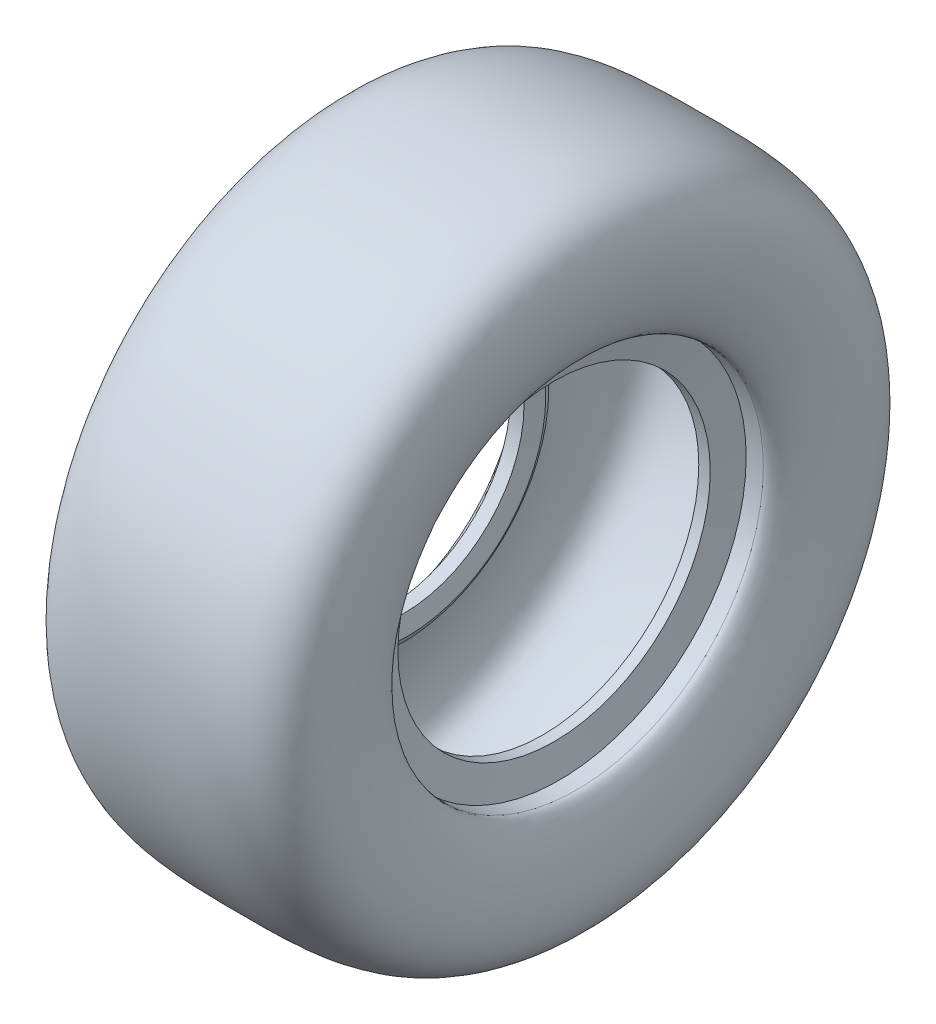
ISO-10303-21;
HEADER;
FILE_DESCRIPTION(('STEP AP214'),'2;1');
FILE_NAME('part.step','',(''),(''),'','','');
FILE_SCHEMA(('AUTOMOTIVE_DESIGN { 1 0 10303 214 1 1 1 1 }'));
ENDSEC;
DATA;
#1=APPLICATION_CONTEXT('core data for automotive mechanical design processes');
#2=APPLICATION_PROTOCOL_DEFINITION('international standard','automotive_design',2000,#1);
#3=PRODUCT_CONTEXT('',#1,'mechanical');
#4=PRODUCT('Part','Part','',(#3));
#5=PRODUCT_RELATED_PRODUCT_CATEGORY('part','',(#4));
#6=PRODUCT_DEFINITION_FORMATION('','',#4);
#7=PRODUCT_DEFINITION_CONTEXT('part definition',#1,'design');
#8=PRODUCT_DEFINITION('design','',#6,#7);
#9=PRODUCT_DEFINITION_SHAPE('','',#8);
#10=(LENGTH_UNIT() NAMED_UNIT(*) SI_UNIT(.MILLI.,.METRE.));
#11=(NAMED_UNIT(*) PLANE_ANGLE_UNIT() SI_UNIT($,.RADIAN.));
#12=(NAMED_UNIT(*) SI_UNIT($,.STERADIAN.) SOLID_ANGLE_UNIT());
#13=UNCERTAINTY_MEASURE_WITH_UNIT(LENGTH_MEASURE(1.E-05),#10,'distance_accuracy_value','');
#14=(GEOMETRIC_REPRESENTATION_CONTEXT(3) GLOBAL_UNCERTAINTY_ASSIGNED_CONTEXT((#13)) GLOBAL_UNIT_ASSIGNED_CONTEXT((#10,
#11,#12)) REPRESENTATION_CONTEXT('',''));
#15=CARTESIAN_POINT('',(0.,0.,0.));
#16=DIRECTION('',(0.,0.,1.));
#17=DIRECTION('',(1.,0.,0.));
#18=AXIS2_PLACEMENT_3D('',#15,#16,#17);
#19=CARTESIAN_POINT('',(3.47266272488094,0.,0.));
#20=DIRECTION('',(-1.,0.,0.));
#21=DIRECTION('',(0.,0.,-1.));
#22=AXIS2_PLACEMENT_3D('',#19,#20,#21);
#23=CONICAL_SURFACE('',#22,17.2497028424639,0.404120577249094);
#24=CARTESIAN_POINT('',(0.594925280990503,0.,0.));
#25=DIRECTION('',(1.,0.,0.));
#26=DIRECTION('',(0.,0.,-1.));
#27=AXIS2_PLACEMENT_3D('',#24,#25,#26);
#28=CIRCLE('',#27,18.4803927868311);
#29=CARTESIAN_POINT('',(0.594925280990503,0.,-18.4803927868311));
#30=VERTEX_POINT('',#29);
#31=EDGE_CURVE('E10',#30,#30,#28,.T.);
#32=ORIENTED_EDGE('',*,*,#31,.T.);
#33=EDGE_LOOP('',(#32));
#34=FACE_BOUND('',#33,.T.);
#35=CARTESIAN_POINT('',(3.47266272488094,0.,0.));
#36=DIRECTION('',(1.,0.,0.));
#37=DIRECTION('',(0.,0.,-1.));
#38=AXIS2_PLACEMENT_3D('',#35,#36,#37);
#39=CIRCLE('',#38,17.2497028424639);
#40=CARTESIAN_POINT('',(3.47266272488094,0.,-17.2497028424639));
#41=VERTEX_POINT('',#40);
#42=EDGE_CURVE('E79',#41,#41,#39,.T.);
#43=ORIENTED_EDGE('',*,*,#42,.F.);
#44=EDGE_LOOP('',(#43));
#45=FACE_BOUND('',#44,.T.);
#46=ADVANCED_FACE('F33',(#34,#45),#23,.T.);
#47=CARTESIAN_POINT('',(0.594925280990491,18.4803927868311,0.));
#48=CARTESIAN_POINT('',(0.569372414542747,18.5081393680591,0.));
#49=CARTESIAN_POINT('',(0.525924239900733,18.5581848339355,0.));
#50=CARTESIAN_POINT('',(0.397789803641084,18.7197551683618,0.));
#51=CARTESIAN_POINT('',(0.20974377840643,18.9880501712404,0.));
#52=CARTESIAN_POINT('',(-0.0508523057953109,19.4100666384776,0.));
#53=CARTESIAN_POINT('',(-0.425084340900271,20.0840697441278,0.));
#54=CARTESIAN_POINT('',(-0.92303713033543,21.1101980177015,0.));
#55=CARTESIAN_POINT('',(-1.51660991726433,22.5639882404766,0.));
#56=CARTESIAN_POINT('',(-2.06345695898781,24.1779072461253,0.));
#57=CARTESIAN_POINT('',(-2.67668909722757,26.461967083874,0.));
#58=CARTESIAN_POINT('',(-3.13114524078678,29.4130902317947,0.));
#59=CARTESIAN_POINT('',(-2.90103725802214,32.5972257606739,0.));
#60=CARTESIAN_POINT('',(-1.98627137097752,34.5018215049126,0.));
#61=CARTESIAN_POINT('',(-0.815019700796387,35.5539158900898,0.));
#62=CARTESIAN_POINT('',(0.896449389503229,36.3885152191131,0.));
#63=CARTESIAN_POINT('',(4.17109004104652,36.9928783683698,0.));
#64=CARTESIAN_POINT('',(8.25481268728258,37.0872177282114,0.));
#65=CARTESIAN_POINT('',(11.7033864270957,37.062973692024,0.));
#66=CARTESIAN_POINT('',(15.1448426824585,37.0523134228786,0.));
#67=CARTESIAN_POINT('',(19.1330908105304,36.9300623418286,0.));
#68=CARTESIAN_POINT('',(22.2430027655649,36.2366041693048,0.));
#69=CARTESIAN_POINT('',(23.9001679162623,35.2636784086857,0.));
#70=CARTESIAN_POINT('',(24.7640377243279,34.3287891412374,0.));
#71=CARTESIAN_POINT('',(25.3525611301634,33.0512886276891,0.));
#72=CARTESIAN_POINT('',(25.6033579101598,31.0992616310925,0.));
#73=CARTESIAN_POINT('',(25.4706804883609,28.7019552678981,0.));
#74=CARTESIAN_POINT('',(25.1062391025157,26.7098719335728,0.));
#75=CARTESIAN_POINT('',(24.7182864232961,25.2972064642427,0.));
#76=CARTESIAN_POINT('',(24.3959823073389,24.3772942437871,0.));
#77=CARTESIAN_POINT('',(24.126684853968,23.7803682980975,0.));
#78=CARTESIAN_POINT('',(23.9235543703579,23.4257016547187,0.));
#79=CARTESIAN_POINT('',(23.8552897921762,23.3247909705258,0.));
#80=CARTESIAN_POINT('',(23.8123289766661,23.268126497952,0.));
#81=B_SPLINE_CURVE_WITH_KNOTS('',3,(#47,#48,#49,#50,#51,#52,#53,#54,#55,#56,#57,#58,#59,#60,#61,
#62,#63,#64,#65,#66,#67,#68,#69,#70,#71,#72,#73,#74,#75,#76,#77,#78,#79,#80),.UNSPECIFIED.,.F.,
.F.,(4,1,1,1,1,1,1,1,1,1,1,1,1,1,1,1,1,1,1,1,1,1,1,1,1,1,1,1,1,1,1,4),(0.0352319070333481,
0.0425536464305465,0.049875385827745,0.0645188646221418,0.0791623434165387,0.0938058222109355,
0.123092779799729,0.152379737388523,0.181666694977317,0.21095365256611,0.269527567743698,
0.328101482921285,0.386675398098873,0.415962355687666,0.44524931327646,0.503823228454047,
0.562397143631635,0.591684101220429,0.620971058809222,0.67954497398681,0.738118889164397,
0.767405846753191,0.796692804341985,0.825979761930778,0.855266719519572,0.884553677108366,
0.913840634697159,0.928484113491556,0.943127592285953,0.95777107108035,0.965092810477548,
0.972414549874747),.UNSPECIFIED.);
#82=CARTESIAN_POINT('',(-9.70191368152623,0.,0.));
#83=DIRECTION('',(-1.,0.,0.));
#84=AXIS1_PLACEMENT('',#82,#83);
#85=SURFACE_OF_REVOLUTION('',#81,#84);
#86=CARTESIAN_POINT('',(23.9646770950238,0.,0.));
#87=DIRECTION('',(1.,0.,0.));
#88=DIRECTION('',(0.,0.,-1.));
#89=AXIS2_PLACEMENT_3D('',#86,#87,#88);
#90=CIRCLE('',#89,23.499584039787);
#91=CARTESIAN_POINT('',(23.9646770950238,0.,-23.499584039787));
#92=VERTEX_POINT('',#91);
#93=EDGE_CURVE('E39',#92,#92,#90,.T.);
#94=ORIENTED_EDGE('',*,*,#93,.T.);
#95=EDGE_LOOP('',(#94));
#96=FACE_BOUND('',#95,.T.);
#97=ORIENTED_EDGE('',*,*,#31,.F.);
#98=EDGE_LOOP('',(#97));
#99=FACE_BOUND('',#98,.T.);
#100=ADVANCED_FACE('F122',(#96,#99),#85,.T.);
#101=CARTESIAN_POINT('',(21.3475901713786,0.,0.));
#102=DIRECTION('',(-1.,0.,0.));
#103=DIRECTION('',(0.,0.,-1.));
#104=AXIS2_PLACEMENT_3D('',#101,#102,#103);
#105=CONICAL_SURFACE('',#104,24.4010866834856,0.331738040239119);
#106=ORIENTED_EDGE('',*,*,#93,.F.);
#107=EDGE_LOOP('',(#106));
#108=FACE_BOUND('',#107,.T.);
#109=CARTESIAN_POINT('',(21.3475901713786,0.,0.));
#110=DIRECTION('',(1.,0.,0.));
#111=DIRECTION('',(0.,0.,-1.));
#112=AXIS2_PLACEMENT_3D('',#109,#110,#111);
#113=CIRCLE('',#112,24.4010866834856);
#114=CARTESIAN_POINT('',(21.3475901713786,0.,-24.4010866834856));
#115=VERTEX_POINT('',#114);
#116=EDGE_CURVE('E43',#115,#115,#113,.T.);
#117=ORIENTED_EDGE('',*,*,#116,.T.);
#118=EDGE_LOOP('',(#117));
#119=FACE_BOUND('',#118,.T.);
#120=ADVANCED_FACE('F119',(#108,#119),#105,.T.);
#121=CARTESIAN_POINT('',(20.,0.,0.));
#122=DIRECTION('',(1.,0.,0.));
#123=DIRECTION('',(0.,0.,1.));
#124=AXIS2_PLACEMENT_3D('',#121,#122,#123);
#125=CONICAL_SURFACE('',#124,21.25,1.16667574954581);
#126=ORIENTED_EDGE('',*,*,#116,.F.);
#127=EDGE_LOOP('',(#126));
#128=FACE_BOUND('',#127,.T.);
#129=CARTESIAN_POINT('',(20.,0.,0.));
#130=DIRECTION('',(1.,0.,0.));
#131=DIRECTION('',(0.,0.,-1.));
#132=AXIS2_PLACEMENT_3D('',#129,#130,#131);
#133=CIRCLE('',#132,21.25);
#134=CARTESIAN_POINT('',(20.,0.,-21.25));
#135=VERTEX_POINT('',#134);
#136=EDGE_CURVE('E47',#135,#135,#133,.T.);
#137=ORIENTED_EDGE('',*,*,#136,.T.);
#138=EDGE_LOOP('',(#137));
#139=FACE_BOUND('',#138,.T.);
#140=ADVANCED_FACE('F115',(#128,#139),#125,.T.);
#141=CARTESIAN_POINT('',(20.,0.,0.));
#142=DIRECTION('',(1.,0.,0.));
#143=DIRECTION('',(0.,0.,1.));
#144=AXIS2_PLACEMENT_3D('',#141,#142,#143);
#145=PLANE('',#144);
#146=CARTESIAN_POINT('',(20.,0.,0.));
#147=DIRECTION('',(1.,0.,0.));
#148=DIRECTION('',(0.,0.,-1.));
#149=AXIS2_PLACEMENT_3D('',#146,#147,#148);
#150=CIRCLE('',#149,18.4);
#151=CARTESIAN_POINT('',(20.,0.,-18.4));
#152=VERTEX_POINT('',#151);
#153=EDGE_CURVE('E52',#152,#152,#150,.T.);
#154=ORIENTED_EDGE('',*,*,#153,.T.);
#155=EDGE_LOOP('',(#154));
#156=FACE_BOUND('',#155,.T.);
#157=ORIENTED_EDGE('',*,*,#136,.F.);
#158=EDGE_LOOP('',(#157));
#159=FACE_BOUND('',#158,.T.);
#160=ADVANCED_FACE('F111',(#156,#159),#145,.F.);
#161=CARTESIAN_POINT('',(-9.70191368152623,0.,0.));
#162=DIRECTION('',(-1.,0.,0.));
#163=DIRECTION('',(0.,0.,-1.));
#164=AXIS2_PLACEMENT_3D('',#161,#162,#163);
#165=CYLINDRICAL_SURFACE('',#164,18.4);
#166=ORIENTED_EDGE('',*,*,#153,.F.);
#167=EDGE_LOOP('',(#166));
#168=FACE_BOUND('',#167,.T.);
#169=CARTESIAN_POINT('',(21.3475901713787,0.,0.));
#170=DIRECTION('',(1.,0.,0.));
#171=DIRECTION('',(0.,0.,-1.));
#172=AXIS2_PLACEMENT_3D('',#169,#170,#171);
#173=CIRCLE('',#172,18.4);
#174=CARTESIAN_POINT('',(21.3475901713787,0.,-18.4));
#175=VERTEX_POINT('',#174);
#176=EDGE_CURVE('E55',#175,#175,#173,.T.);
#177=ORIENTED_EDGE('',*,*,#176,.T.);
#178=EDGE_LOOP('',(#177));
#179=FACE_BOUND('',#178,.T.);
#180=ADVANCED_FACE('F107',(#168,#179),#165,.F.);
#181=CARTESIAN_POINT('',(21.9823673019292,0.,0.));
#182=DIRECTION('',(1.,0.,0.));
#183=DIRECTION('',(0.,0.,1.));
#184=AXIS2_PLACEMENT_3D('',#181,#182,#183);
#185=CONICAL_SURFACE('',#184,22.,1.39626340159546);
#186=ORIENTED_EDGE('',*,*,#176,.F.);
#187=EDGE_LOOP('',(#186));
#188=FACE_BOUND('',#187,.T.);
#189=CARTESIAN_POINT('',(21.9823673019292,0.,0.));
#190=DIRECTION('',(1.,0.,0.));
#191=DIRECTION('',(0.,0.,-1.));
#192=AXIS2_PLACEMENT_3D('',#189,#190,#191);
#193=CIRCLE('',#192,22.);
#194=CARTESIAN_POINT('',(21.9823673019292,0.,-22.));
#195=VERTEX_POINT('',#194);
#196=EDGE_CURVE('E58',#195,#195,#193,.T.);
#197=ORIENTED_EDGE('',*,*,#196,.T.);
#198=EDGE_LOOP('',(#197));
#199=FACE_BOUND('',#198,.T.);
#200=ADVANCED_FACE('F103',(#188,#199),#185,.F.);
#201=CARTESIAN_POINT('',(-9.70191368152623,0.,0.));
#202=DIRECTION('',(-1.,0.,0.));
#203=DIRECTION('',(0.,0.,-1.));
#204=AXIS2_PLACEMENT_3D('',#201,#202,#203);
#205=CYLINDRICAL_SURFACE('',#204,22.);
#206=ORIENTED_EDGE('',*,*,#196,.F.);
#207=EDGE_LOOP('',(#206));
#208=FACE_BOUND('',#207,.T.);
#209=CARTESIAN_POINT('',(24.,0.,0.));
#210=DIRECTION('',(1.,0.,0.));
#211=DIRECTION('',(0.,0.,-1.));
#212=AXIS2_PLACEMENT_3D('',#209,#210,#211);
#213=CIRCLE('',#212,22.);
#214=CARTESIAN_POINT('',(24.,0.,-22.));
#215=VERTEX_POINT('',#214);
#216=EDGE_CURVE('E61',#215,#215,#213,.T.);
#217=ORIENTED_EDGE('',*,*,#216,.T.);
#218=EDGE_LOOP('',(#217));
#219=FACE_BOUND('',#218,.T.);
#220=ADVANCED_FACE('F98',(#208,#219),#205,.F.);
#221=CARTESIAN_POINT('',(0.,17.125,0.));
#222=CARTESIAN_POINT('',(-1.63878066882199,17.3562966084539,0.));
#223=CARTESIAN_POINT('',(-11.288304265849,38.6849759848854,0.));
#224=CARTESIAN_POINT('',(13.6797692681942,38.4103130216317,0.));
#225=CARTESIAN_POINT('',(29.9662875421091,38.7543069486207,0.));
#226=CARTESIAN_POINT('',(25.4776633391417,22.0348065599062,0.));
#227=CARTESIAN_POINT('',(24.,22.,0.));
#228=B_SPLINE_CURVE_WITH_KNOTS('',3,(#221,#222,#223,#224,#225,#226,#227),.UNSPECIFIED.,.F.,.F.,
(4,1,1,1,4),(0.,0.417457681233407,0.595980708620633,0.83131266485226,1.),.UNSPECIFIED.);
#229=CARTESIAN_POINT('',(-9.70191368152623,0.,0.));
#230=DIRECTION('',(-1.,0.,0.));
#231=AXIS1_PLACEMENT('',#229,#230);
#232=SURFACE_OF_REVOLUTION('',#228,#231);
#233=ORIENTED_EDGE('',*,*,#216,.F.);
#234=EDGE_LOOP('',(#233));
#235=FACE_BOUND('',#234,.T.);
#236=CARTESIAN_POINT('',(0.,0.,0.));
#237=DIRECTION('',(1.,0.,0.));
#238=DIRECTION('',(0.,0.,-1.));
#239=AXIS2_PLACEMENT_3D('',#236,#237,#238);
#240=CIRCLE('',#239,17.125);
#241=CARTESIAN_POINT('',(0.,0.,-17.125));
#242=VERTEX_POINT('',#241);
#243=EDGE_CURVE('E64',#242,#242,#240,.T.);
#244=ORIENTED_EDGE('',*,*,#243,.T.);
#245=EDGE_LOOP('',(#244));
#246=FACE_BOUND('',#245,.T.);
#247=ADVANCED_FACE('F93',(#235,#246),#232,.F.);
#248=CARTESIAN_POINT('',(-9.70191368152623,0.,0.));
#249=DIRECTION('',(-1.,0.,0.));
#250=DIRECTION('',(0.,0.,-1.));
#251=AXIS2_PLACEMENT_3D('',#248,#249,#250);
#252=CYLINDRICAL_SURFACE('',#251,17.125);
#253=ORIENTED_EDGE('',*,*,#243,.F.);
#254=EDGE_LOOP('',(#253));
#255=FACE_BOUND('',#254,.T.);
#256=CARTESIAN_POINT('',(1.99999999999999,0.,0.));
#257=DIRECTION('',(1.,0.,0.));
#258=DIRECTION('',(0.,0.,-1.));
#259=AXIS2_PLACEMENT_3D('',#256,#257,#258);
#260=CIRCLE('',#259,17.125);
#261=CARTESIAN_POINT('',(1.99999999999999,0.,-17.125));
#262=VERTEX_POINT('',#261);
#263=EDGE_CURVE('E67',#262,#262,#260,.T.);
#264=ORIENTED_EDGE('',*,*,#263,.T.);
#265=EDGE_LOOP('',(#264));
#266=FACE_BOUND('',#265,.T.);
#267=ADVANCED_FACE('F97',(#255,#266),#252,.F.);
#268=CARTESIAN_POINT('',(1.99999999999999,0.,0.));
#269=DIRECTION('',(1.,0.,0.));
#270=DIRECTION('',(0.,0.,1.));
#271=AXIS2_PLACEMENT_3D('',#268,#269,#270);
#272=PLANE('',#271);
#273=CARTESIAN_POINT('',(1.99999999999999,0.,0.));
#274=DIRECTION('',(1.,0.,0.));
#275=DIRECTION('',(0.,0.,-1.));
#276=AXIS2_PLACEMENT_3D('',#273,#274,#275);
#277=CIRCLE('',#276,14.2);
#278=CARTESIAN_POINT('',(1.99999999999999,0.,-14.2));
#279=VERTEX_POINT('',#278);
#280=EDGE_CURVE('E70',#279,#279,#277,.T.);
#281=ORIENTED_EDGE('',*,*,#280,.T.);
#282=EDGE_LOOP('',(#281));
#283=FACE_BOUND('',#282,.T.);
#284=ORIENTED_EDGE('',*,*,#263,.F.);
#285=EDGE_LOOP('',(#284));
#286=FACE_BOUND('',#285,.T.);
#287=ADVANCED_FACE('F148',(#283,#286),#272,.F.);
#288=CARTESIAN_POINT('',(-9.70191368152623,0.,0.));
#289=DIRECTION('',(-1.,0.,0.));
#290=DIRECTION('',(0.,0.,-1.));
#291=AXIS2_PLACEMENT_3D('',#288,#289,#290);
#292=CYLINDRICAL_SURFACE('',#291,14.2);
#293=ORIENTED_EDGE('',*,*,#280,.F.);
#294=EDGE_LOOP('',(#293));
#295=FACE_BOUND('',#294,.T.);
#296=CARTESIAN_POINT('',(3.61208064244136,0.,0.));
#297=DIRECTION('',(1.,0.,0.));
#298=DIRECTION('',(0.,0.,-1.));
#299=AXIS2_PLACEMENT_3D('',#296,#297,#298);
#300=CIRCLE('',#299,14.2);
#301=CARTESIAN_POINT('',(3.61208064244136,0.,-14.2));
#302=VERTEX_POINT('',#301);
#303=EDGE_CURVE('E73',#302,#302,#300,.T.);
#304=ORIENTED_EDGE('',*,*,#303,.T.);
#305=EDGE_LOOP('',(#304));
#306=FACE_BOUND('',#305,.T.);
#307=ADVANCED_FACE('F142',(#295,#306),#292,.F.);
#308=CARTESIAN_POINT('',(3.99559182548228,0.,0.));
#309=DIRECTION('',(1.,0.,0.));
#310=DIRECTION('',(0.,0.,1.));
#311=AXIS2_PLACEMENT_3D('',#308,#309,#310);
#312=CONICAL_SURFACE('',#311,16.375,1.39626340159546);
#313=ORIENTED_EDGE('',*,*,#303,.F.);
#314=EDGE_LOOP('',(#313));
#315=FACE_BOUND('',#314,.T.);
#316=CARTESIAN_POINT('',(3.99559182548228,0.,0.));
#317=DIRECTION('',(1.,0.,0.));
#318=DIRECTION('',(0.,0.,-1.));
#319=AXIS2_PLACEMENT_3D('',#316,#317,#318);
#320=CIRCLE('',#319,16.375);
#321=CARTESIAN_POINT('',(3.99559182548228,0.,-16.375));
#322=VERTEX_POINT('',#321);
#323=EDGE_CURVE('E76',#322,#322,#320,.T.);
#324=ORIENTED_EDGE('',*,*,#323,.T.);
#325=EDGE_LOOP('',(#324));
#326=FACE_BOUND('',#325,.T.);
#327=ADVANCED_FACE('F137',(#315,#326),#312,.F.);
#328=CARTESIAN_POINT('',(3.99559182548228,0.,0.));
#329=DIRECTION('',(-1.,0.,0.));
#330=DIRECTION('',(0.,0.,-1.));
#331=AXIS2_PLACEMENT_3D('',#328,#329,#330);
#332=CONICAL_SURFACE('',#331,16.375,1.03196930990185);
#333=ORIENTED_EDGE('',*,*,#42,.T.);
#334=EDGE_LOOP('',(#333));
#335=FACE_BOUND('',#334,.T.);
#336=ORIENTED_EDGE('',*,*,#323,.F.);
#337=EDGE_LOOP('',(#336));
#338=FACE_BOUND('',#337,.T.);
#339=ADVANCED_FACE('F134',(#335,#338),#332,.T.);
#340=CLOSED_SHELL('',(#46,#100,#120,#140,#160,#180,#200,#220,#247,#267,#287,#307,#327,#339));
#341=MANIFOLD_SOLID_BREP('B2',#340);
#342=ADVANCED_BREP_SHAPE_REPRESENTATION('',(#18,#341),#14);
#343=SHAPE_DEFINITION_REPRESENTATION(#9,#342);
ENDSEC;
END-ISO-10303-21;
